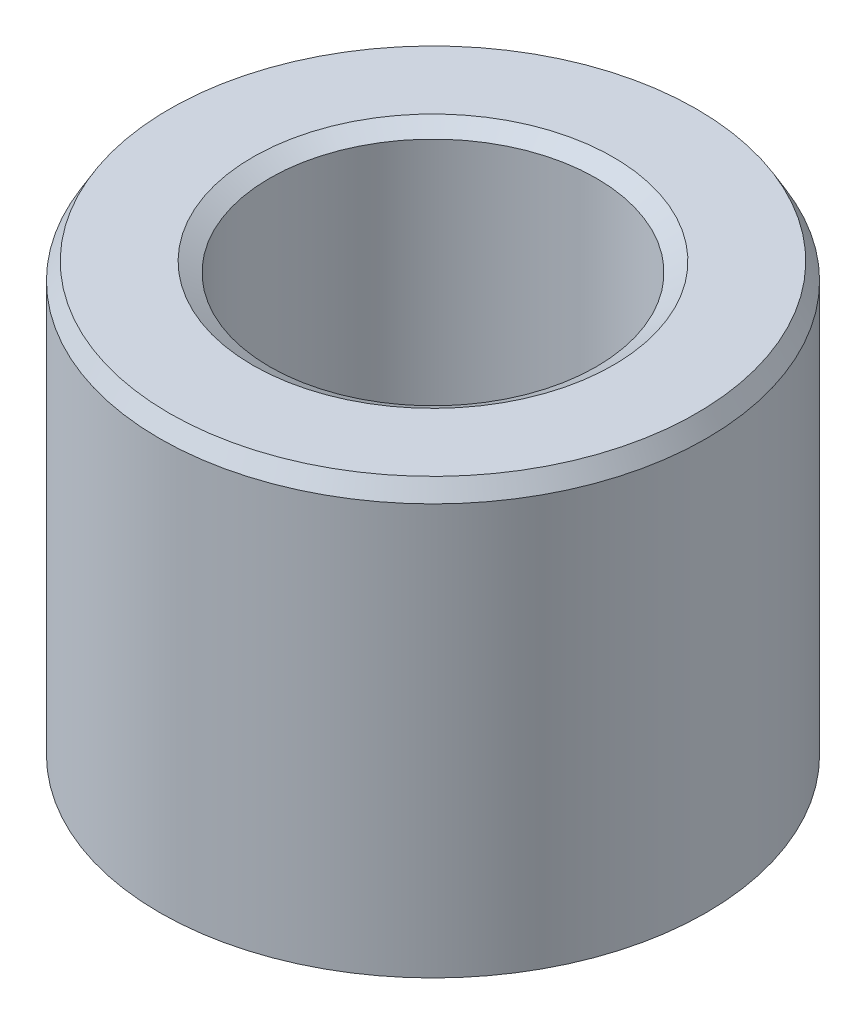
ISO-10303-21;
HEADER;
FILE_DESCRIPTION(('STEP AP214'),'2;1');
FILE_NAME('part.step','',(''),(''),'','','');
FILE_SCHEMA(('AUTOMOTIVE_DESIGN { 1 0 10303 214 1 1 1 1 }'));
ENDSEC;
DATA;
#1=APPLICATION_CONTEXT('core data for automotive mechanical design processes');
#2=APPLICATION_PROTOCOL_DEFINITION('international standard','automotive_design',2000,#1);
#3=PRODUCT_CONTEXT('',#1,'mechanical');
#4=PRODUCT('Part','Part','',(#3));
#5=PRODUCT_RELATED_PRODUCT_CATEGORY('part','',(#4));
#6=PRODUCT_DEFINITION_FORMATION('','',#4);
#7=PRODUCT_DEFINITION_CONTEXT('part definition',#1,'design');
#8=PRODUCT_DEFINITION('design','',#6,#7);
#9=PRODUCT_DEFINITION_SHAPE('','',#8);
#10=(LENGTH_UNIT() NAMED_UNIT(*) SI_UNIT(.MILLI.,.METRE.));
#11=(NAMED_UNIT(*) PLANE_ANGLE_UNIT() SI_UNIT($,.RADIAN.));
#12=(NAMED_UNIT(*) SI_UNIT($,.STERADIAN.) SOLID_ANGLE_UNIT());
#13=UNCERTAINTY_MEASURE_WITH_UNIT(LENGTH_MEASURE(1.E-05),#10,'distance_accuracy_value','');
#14=(GEOMETRIC_REPRESENTATION_CONTEXT(3) GLOBAL_UNCERTAINTY_ASSIGNED_CONTEXT((#13)) GLOBAL_UNIT_ASSIGNED_CONTEXT((#10,
#11,#12)) REPRESENTATION_CONTEXT('',''));
#15=CARTESIAN_POINT('',(0.,0.,0.));
#16=DIRECTION('',(0.,0.,1.));
#17=DIRECTION('',(1.,0.,0.));
#18=AXIS2_PLACEMENT_3D('',#15,#16,#17);
#19=CARTESIAN_POINT('',(0.,51.9870762394011,0.));
#20=DIRECTION('',(0.,-1.,0.));
#21=DIRECTION('',(0.,0.,-1.));
#22=AXIS2_PLACEMENT_3D('',#19,#20,#21);
#23=CYLINDRICAL_SURFACE('',#22,32.5);
#24=CARTESIAN_POINT('',(0.,1.16244475086012,0.));
#25=DIRECTION('',(0.,1.,0.));
#26=DIRECTION('',(0.,0.,1.));
#27=AXIS2_PLACEMENT_3D('',#24,#25,#26);
#28=CIRCLE('',#27,32.5);
#29=CARTESIAN_POINT('',(0.,1.16244475086012,-32.5));
#30=VERTEX_POINT('',#29);
#31=EDGE_CURVE('E10',#30,#30,#28,.T.);
#32=CARTESIAN_POINT('',(0.,49.9736628699198,0.));
#33=DIRECTION('',(0.,1.,0.));
#34=DIRECTION('',(0.,0.,1.));
#35=AXIS2_PLACEMENT_3D('',#32,#33,#34);
#36=CIRCLE('',#35,32.5);
#37=CARTESIAN_POINT('',(0.,49.9736628699198,-32.5));
#38=VERTEX_POINT('',#37);
#39=EDGE_CURVE('E50',#38,#38,#36,.F.);
#40=CARTESIAN_POINT('',(0.,1.16244475086012,-32.5));
#41=CARTESIAN_POINT('',(0.,1.67089493960032,-32.5));
#42=CARTESIAN_POINT('',(0.,2.17934512834052,-32.5));
#43=CARTESIAN_POINT('',(0.,3.19624550582093,-32.5));
#44=CARTESIAN_POINT('',(0.,3.70469569456114,-32.5));
#45=CARTESIAN_POINT('',(0.,4.72159607204155,-32.5));
#46=CARTESIAN_POINT('',(0.,5.23004626078176,-32.5));
#47=CARTESIAN_POINT('',(0.,6.24694663826217,-32.5));
#48=CARTESIAN_POINT('',(0.,6.75539682700237,-32.5));
#49=CARTESIAN_POINT('',(0.,7.77229720448278,-32.5));
#50=CARTESIAN_POINT('',(0.,8.28074739322299,-32.5));
#51=CARTESIAN_POINT('',(0.,9.2976477707034,-32.5));
#52=CARTESIAN_POINT('',(0.,9.8060979594436,-32.5));
#53=CARTESIAN_POINT('',(0.,10.822998336924,-32.5));
#54=CARTESIAN_POINT('',(0.,11.3314485256642,-32.5));
#55=CARTESIAN_POINT('',(0.,12.3483489031446,-32.5));
#56=CARTESIAN_POINT('',(0.,12.8567990918848,-32.5));
#57=CARTESIAN_POINT('',(0.,13.8736994693652,-32.5));
#58=CARTESIAN_POINT('',(0.,14.3821496581054,-32.5));
#59=CARTESIAN_POINT('',(0.,15.3990500355859,-32.5));
#60=CARTESIAN_POINT('',(0.,15.9075002243261,-32.5));
#61=CARTESIAN_POINT('',(0.,16.9244006018065,-32.5));
#62=CARTESIAN_POINT('',(0.,17.4328507905467,-32.5));
#63=CARTESIAN_POINT('',(0.,18.4497511680271,-32.5));
#64=CARTESIAN_POINT('',(0.,18.9582013567673,-32.5));
#65=CARTESIAN_POINT('',(0.,19.9751017342477,-32.5));
#66=CARTESIAN_POINT('',(0.,20.4835519229879,-32.5));
#67=CARTESIAN_POINT('',(0.,21.5004523004683,-32.5));
#68=CARTESIAN_POINT('',(0.,22.0089024892085,-32.5));
#69=CARTESIAN_POINT('',(0.,23.0258028666889,-32.5));
#70=CARTESIAN_POINT('',(0.,23.5342530554291,-32.5));
#71=CARTESIAN_POINT('',(0.,24.5511534329095,-32.5));
#72=CARTESIAN_POINT('',(0.,25.0596036216497,-32.5));
#73=CARTESIAN_POINT('',(0.,26.0765039991302,-32.5));
#74=CARTESIAN_POINT('',(0.,26.5849541878704,-32.5));
#75=CARTESIAN_POINT('',(0.,27.6018545653508,-32.5));
#76=CARTESIAN_POINT('',(0.,28.110304754091,-32.5));
#77=CARTESIAN_POINT('',(0.,29.1272051315714,-32.5));
#78=CARTESIAN_POINT('',(0.,29.6356553203116,-32.5));
#79=CARTESIAN_POINT('',(0.,30.652555697792,-32.5));
#80=CARTESIAN_POINT('',(0.,31.1610058865322,-32.5));
#81=CARTESIAN_POINT('',(0.,32.1779062640126,-32.5));
#82=CARTESIAN_POINT('',(0.,32.6863564527528,-32.5));
#83=CARTESIAN_POINT('',(0.,33.7032568302332,-32.5));
#84=CARTESIAN_POINT('',(0.,34.2117070189734,-32.5));
#85=CARTESIAN_POINT('',(0.,35.2286073964538,-32.5));
#86=CARTESIAN_POINT('',(0.,35.7370575851941,-32.5));
#87=CARTESIAN_POINT('',(0.,36.7539579626745,-32.5));
#88=CARTESIAN_POINT('',(0.,37.2624081514147,-32.5));
#89=CARTESIAN_POINT('',(0.,38.2793085288951,-32.5));
#90=CARTESIAN_POINT('',(0.,38.7877587176353,-32.5));
#91=CARTESIAN_POINT('',(0.,39.8046590951157,-32.5));
#92=CARTESIAN_POINT('',(0.,40.3131092838559,-32.5));
#93=CARTESIAN_POINT('',(0.,41.3300096613363,-32.5));
#94=CARTESIAN_POINT('',(0.,41.8384598500765,-32.5));
#95=CARTESIAN_POINT('',(0.,42.8553602275569,-32.5));
#96=CARTESIAN_POINT('',(0.,43.3638104162971,-32.5));
#97=CARTESIAN_POINT('',(0.,44.3807107937775,-32.5));
#98=CARTESIAN_POINT('',(0.,44.8891609825177,-32.5));
#99=CARTESIAN_POINT('',(0.,45.9060613599981,-32.5));
#100=CARTESIAN_POINT('',(0.,46.4145115487384,-32.5));
#101=CARTESIAN_POINT('',(0.,47.4314119262188,-32.5));
#102=CARTESIAN_POINT('',(0.,47.939862114959,-32.5));
#103=CARTESIAN_POINT('',(0.,48.9567624924394,-32.5));
#104=CARTESIAN_POINT('',(0.,49.4652126811796,-32.5));
#105=CARTESIAN_POINT('',(0.,49.9736628699198,-32.5));
#106=B_SPLINE_CURVE_WITH_KNOTS('',3,(#40,#41,#42,#43,#44,#45,#46,#47,#48,#49,#50,#51,#52,#53,
#54,#55,#56,#57,#58,#59,#60,#61,#62,#63,#64,#65,#66,#67,#68,#69,#70,#71,#72,#73,#74,#75,#76,#77,
#78,#79,#80,#81,#82,#83,#84,#85,#86,#87,#88,#89,#90,#91,#92,#93,#94,#95,#96,#97,#98,#99,#100,
#101,#102,#103,#104,#105),.UNSPECIFIED.,.F.,.F.,(4,2,2,2,2,2,2,2,2,2,2,2,2,2,2,2,2,2,2,2,2,2,2,
2,2,2,2,2,2,2,2,2,4),(0.,1.52535056622061,3.05070113244123,4.57605169866185,6.10140226488246,
7.62675283110308,9.15210339732369,10.6774539635443,12.2028045297649,13.7281550959855,
15.2535056622062,16.7788562284268,18.3042067946474,19.829557360868,21.3549079270886,
22.8802584933092,24.4056090595298,25.9309596257505,27.4563101919711,28.9816607581917,
30.5070113244123,32.0323618906329,33.5577124568535,35.0830630230741,36.6084135892947,
38.1337641555154,39.659114721736,41.1844652879566,42.7098158541772,44.2351664203978,
45.7605169866184,47.2858675528391,48.8112181190597),.UNSPECIFIED.);
#107=EDGE_CURVE('BSEAM39',#30,#38,#106,.T.);
#108=ORIENTED_EDGE('',*,*,#31,.T.);
#109=ORIENTED_EDGE('',*,*,#39,.T.);
#110=ORIENTED_EDGE('',*,*,#107,.T.);
#111=ORIENTED_EDGE('',*,*,#107,.F.);
#112=EDGE_LOOP('',(#108,#110,#109,#111));
#113=FACE_BOUND('',#112,.T.);
#114=ADVANCED_FACE('F39',(#113),#23,.T.);
#115=CARTESIAN_POINT('',(0.,51.9870762394011,0.));
#116=DIRECTION('',(0.,1.,0.));
#117=DIRECTION('',(0.,0.,1.));
#118=AXIS2_PLACEMENT_3D('',#115,#116,#117);
#119=PLANE('',#118);
#120=CARTESIAN_POINT('',(0.,51.9870762394011,0.));
#121=DIRECTION('',(0.,1.,0.));
#122=DIRECTION('',(0.,0.,1.));
#123=AXIS2_PLACEMENT_3D('',#120,#121,#122);
#124=CIRCLE('',#123,21.4318397049563);
#125=CARTESIAN_POINT('',(0.,51.9870762394011,21.4318397049563));
#126=VERTEX_POINT('',#125);
#127=EDGE_CURVE('E58',#126,#126,#124,.F.);
#128=ORIENTED_EDGE('',*,*,#127,.T.);
#129=EDGE_LOOP('',(#128));
#130=FACE_BOUND('',#129,.T.);
#131=CARTESIAN_POINT('',(0.,51.9870762394011,0.));
#132=DIRECTION('',(0.,1.,0.));
#133=DIRECTION('',(0.,0.,1.));
#134=AXIS2_PLACEMENT_3D('',#131,#132,#133);
#135=CIRCLE('',#134,31.33755524914);
#136=CARTESIAN_POINT('',(0.,51.9870762394011,31.33755524914));
#137=VERTEX_POINT('',#136);
#138=EDGE_CURVE('E61',#137,#137,#135,.T.);
#139=ORIENTED_EDGE('',*,*,#138,.T.);
#140=EDGE_LOOP('',(#139));
#141=FACE_BOUND('',#140,.T.);
#142=ADVANCED_FACE('F88',(#130,#141),#119,.T.);
#143=CARTESIAN_POINT('',(0.,0.,0.));
#144=DIRECTION('',(0.,1.,0.));
#145=DIRECTION('',(0.,0.,1.));
#146=AXIS2_PLACEMENT_3D('',#143,#144,#145);
#147=PLANE('',#146);
#148=CARTESIAN_POINT('',(0.,0.,0.));
#149=DIRECTION('',(0.,1.,0.));
#150=DIRECTION('',(0.,0.,1.));
#151=AXIS2_PLACEMENT_3D('',#148,#149,#150);
#152=CIRCLE('',#151,20.5808710863349);
#153=CARTESIAN_POINT('',(0.,0.,20.5808710863349));
#154=VERTEX_POINT('',#153);
#155=EDGE_CURVE('E51',#154,#154,#152,.T.);
#156=ORIENTED_EDGE('',*,*,#155,.T.);
#157=EDGE_LOOP('',(#156));
#158=FACE_BOUND('',#157,.T.);
#159=CARTESIAN_POINT('',(0.,0.,0.));
#160=DIRECTION('',(0.,1.,0.));
#161=DIRECTION('',(0.,0.,1.));
#162=AXIS2_PLACEMENT_3D('',#159,#160,#161);
#163=CIRCLE('',#162,30.4865866305185);
#164=CARTESIAN_POINT('',(0.,0.,30.4865866305185));
#165=VERTEX_POINT('',#164);
#166=EDGE_CURVE('E54',#165,#165,#163,.F.);
#167=ORIENTED_EDGE('',*,*,#166,.T.);
#168=EDGE_LOOP('',(#167));
#169=FACE_BOUND('',#168,.T.);
#170=ADVANCED_FACE('F83',(#158,#169),#147,.F.);
#171=CARTESIAN_POINT('',(0.,51.9870762394011,0.));
#172=DIRECTION('',(0.,-1.,0.));
#173=DIRECTION('',(0.,0.,-1.));
#174=AXIS2_PLACEMENT_3D('',#171,#172,#173);
#175=CYLINDRICAL_SURFACE('',#174,19.4184263354748);
#176=CARTESIAN_POINT('',(0.,50.824631488541,0.));
#177=DIRECTION('',(0.,1.,0.));
#178=DIRECTION('',(0.,0.,1.));
#179=AXIS2_PLACEMENT_3D('',#176,#177,#178);
#180=CIRCLE('',#179,19.4184263354748);
#181=CARTESIAN_POINT('',(0.,50.824631488541,-19.4184263354748));
#182=VERTEX_POINT('',#181);
#183=EDGE_CURVE('E67',#182,#182,#180,.T.);
#184=CARTESIAN_POINT('',(0.,2.01341336948142,0.));
#185=DIRECTION('',(0.,1.,0.));
#186=DIRECTION('',(0.,0.,1.));
#187=AXIS2_PLACEMENT_3D('',#184,#185,#186);
#188=CIRCLE('',#187,19.4184263354748);
#189=CARTESIAN_POINT('',(0.,2.01341336948142,-19.4184263354748));
#190=VERTEX_POINT('',#189);
#191=EDGE_CURVE('E69',#190,#190,#188,.F.);
#192=CARTESIAN_POINT('',(0.,50.824631488541,-19.4184263354748));
#193=CARTESIAN_POINT('',(0.,50.3161812998008,-19.4184263354748));
#194=CARTESIAN_POINT('',(0.,49.8077311110606,-19.4184263354748));
#195=CARTESIAN_POINT('',(0.,48.7908307335802,-19.4184263354748));
#196=CARTESIAN_POINT('',(0.,48.28238054484,-19.4184263354748));
#197=CARTESIAN_POINT('',(0.,47.2654801673596,-19.4184263354748));
#198=CARTESIAN_POINT('',(0.,46.7570299786194,-19.4184263354748));
#199=CARTESIAN_POINT('',(0.,45.740129601139,-19.4184263354748));
#200=CARTESIAN_POINT('',(0.,45.2316794123988,-19.4184263354748));
#201=CARTESIAN_POINT('',(0.,44.2147790349184,-19.4184263354748));
#202=CARTESIAN_POINT('',(0.,43.7063288461782,-19.4184263354748));
#203=CARTESIAN_POINT('',(0.,42.6894284686977,-19.4184263354748));
#204=CARTESIAN_POINT('',(0.,42.1809782799575,-19.4184263354748));
#205=CARTESIAN_POINT('',(0.,41.1640779024771,-19.4184263354748));
#206=CARTESIAN_POINT('',(0.,40.6556277137369,-19.4184263354748));
#207=CARTESIAN_POINT('',(0.,39.6387273362565,-19.4184263354748));
#208=CARTESIAN_POINT('',(0.,39.1302771475163,-19.4184263354748));
#209=CARTESIAN_POINT('',(0.,38.1133767700359,-19.4184263354748));
#210=CARTESIAN_POINT('',(0.,37.6049265812957,-19.4184263354748));
#211=CARTESIAN_POINT('',(0.,36.5880262038153,-19.4184263354748));
#212=CARTESIAN_POINT('',(0.,36.0795760150751,-19.4184263354748));
#213=CARTESIAN_POINT('',(0.,35.0626756375947,-19.4184263354748));
#214=CARTESIAN_POINT('',(0.,34.5542254488545,-19.4184263354748));
#215=CARTESIAN_POINT('',(0.,33.5373250713741,-19.4184263354748));
#216=CARTESIAN_POINT('',(0.,33.0288748826339,-19.4184263354748));
#217=CARTESIAN_POINT('',(0.,32.0119745051535,-19.4184263354748));
#218=CARTESIAN_POINT('',(0.,31.5035243164133,-19.4184263354748));
#219=CARTESIAN_POINT('',(0.,30.4866239389328,-19.4184263354748));
#220=CARTESIAN_POINT('',(0.,29.9781737501926,-19.4184263354748));
#221=CARTESIAN_POINT('',(0.,28.9612733727122,-19.4184263354748));
#222=CARTESIAN_POINT('',(0.,28.452823183972,-19.4184263354748));
#223=CARTESIAN_POINT('',(0.,27.4359228064916,-19.4184263354748));
#224=CARTESIAN_POINT('',(0.,26.9274726177514,-19.4184263354748));
#225=CARTESIAN_POINT('',(0.,25.910572240271,-19.4184263354748));
#226=CARTESIAN_POINT('',(0.,25.4021220515308,-19.4184263354748));
#227=CARTESIAN_POINT('',(0.,24.3852216740504,-19.4184263354748));
#228=CARTESIAN_POINT('',(0.,23.8767714853102,-19.4184263354748));
#229=CARTESIAN_POINT('',(0.,22.8598711078298,-19.4184263354748));
#230=CARTESIAN_POINT('',(0.,22.3514209190896,-19.4184263354748));
#231=CARTESIAN_POINT('',(0.,21.3345205416092,-19.4184263354748));
#232=CARTESIAN_POINT('',(0.,20.826070352869,-19.4184263354748));
#233=CARTESIAN_POINT('',(0.,19.8091699753886,-19.4184263354748));
#234=CARTESIAN_POINT('',(0.,19.3007197866484,-19.4184263354748));
#235=CARTESIAN_POINT('',(0.,18.283819409168,-19.4184263354748));
#236=CARTESIAN_POINT('',(0.,17.7753692204277,-19.4184263354748));
#237=CARTESIAN_POINT('',(0.,16.7584688429473,-19.4184263354748));
#238=CARTESIAN_POINT('',(0.,16.2500186542071,-19.4184263354748));
#239=CARTESIAN_POINT('',(0.,15.2331182767267,-19.4184263354748));
#240=CARTESIAN_POINT('',(0.,14.7246680879865,-19.4184263354748));
#241=CARTESIAN_POINT('',(0.,13.7077677105061,-19.4184263354748));
#242=CARTESIAN_POINT('',(0.,13.1993175217659,-19.4184263354748));
#243=CARTESIAN_POINT('',(0.,12.1824171442855,-19.4184263354748));
#244=CARTESIAN_POINT('',(0.,11.6739669555453,-19.4184263354748));
#245=CARTESIAN_POINT('',(0.,10.6570665780649,-19.4184263354748));
#246=CARTESIAN_POINT('',(0.,10.1486163893247,-19.4184263354748));
#247=CARTESIAN_POINT('',(0.,9.13171601184428,-19.4184263354748));
#248=CARTESIAN_POINT('',(0.,8.62326582310407,-19.4184263354748));
#249=CARTESIAN_POINT('',(0.,7.60636544562366,-19.4184263354748));
#250=CARTESIAN_POINT('',(0.,7.09791525688346,-19.4184263354748));
#251=CARTESIAN_POINT('',(0.,6.08101487940305,-19.4184263354748));
#252=CARTESIAN_POINT('',(0.,5.57256469066285,-19.4184263354748));
#253=CARTESIAN_POINT('',(0.,4.55566431318244,-19.4184263354748));
#254=CARTESIAN_POINT('',(0.,4.04721412444224,-19.4184263354748));
#255=CARTESIAN_POINT('',(0.,3.03031374696183,-19.4184263354748));
#256=CARTESIAN_POINT('',(0.,2.52186355822162,-19.4184263354748));
#257=CARTESIAN_POINT('',(0.,2.01341336948142,-19.4184263354748));
#258=B_SPLINE_CURVE_WITH_KNOTS('',3,(#192,#193,#194,#195,#196,#197,#198,#199,#200,#201,#202,
#203,#204,#205,#206,#207,#208,#209,#210,#211,#212,#213,#214,#215,#216,#217,#218,#219,#220,#221,
#222,#223,#224,#225,#226,#227,#228,#229,#230,#231,#232,#233,#234,#235,#236,#237,#238,#239,#240,
#241,#242,#243,#244,#245,#246,#247,#248,#249,#250,#251,#252,#253,#254,#255,#256,#257),
.UNSPECIFIED.,.F.,.F.,(4,2,2,2,2,2,2,2,2,2,2,2,2,2,2,2,2,2,2,2,2,2,2,2,2,2,2,2,2,2,2,2,4),(0.,
1.52535056622061,3.05070113244123,4.57605169866184,6.10140226488245,7.62675283110306,
9.15210339732368,10.6774539635443,12.2028045297649,13.7281550959855,15.2535056622061,
16.7788562284267,18.3042067946474,19.829557360868,21.3549079270886,22.8802584933092,
24.4056090595298,25.9309596257504,27.456310191971,28.9816607581916,30.5070113244122,
32.0323618906329,33.5577124568535,35.0830630230741,36.6084135892947,38.1337641555153,
39.6591147217359,41.1844652879565,42.7098158541771,44.2351664203978,45.7605169866184,
47.285867552839,48.8112181190596),.UNSPECIFIED.);
#259=EDGE_CURVE('BSEAM71',#182,#190,#258,.T.);
#260=ORIENTED_EDGE('',*,*,#183,.T.);
#261=ORIENTED_EDGE('',*,*,#191,.T.);
#262=ORIENTED_EDGE('',*,*,#259,.T.);
#263=ORIENTED_EDGE('',*,*,#259,.F.);
#264=EDGE_LOOP('',(#260,#262,#261,#263));
#265=FACE_BOUND('',#264,.T.);
#266=ADVANCED_FACE('F71',(#265),#175,.F.);
#267=CARTESIAN_POINT('',(0.,50.824631488541,0.));
#268=DIRECTION('',(0.,1.,0.));
#269=DIRECTION('',(0.,0.,1.));
#270=AXIS2_PLACEMENT_3D('',#267,#268,#269);
#271=CONICAL_SURFACE('',#270,19.4184263354748,1.0471975511966);
#272=ORIENTED_EDGE('',*,*,#127,.F.);
#273=EDGE_LOOP('',(#272));
#274=FACE_BOUND('',#273,.T.);
#275=ORIENTED_EDGE('',*,*,#183,.F.);
#276=EDGE_LOOP('',(#275));
#277=FACE_BOUND('',#276,.T.);
#278=ADVANCED_FACE('F77',(#274,#277),#271,.F.);
#279=CARTESIAN_POINT('',(0.,0.,0.));
#280=DIRECTION('',(0.,-1.,0.));
#281=DIRECTION('',(0.,0.,-1.));
#282=AXIS2_PLACEMENT_3D('',#279,#280,#281);
#283=CONICAL_SURFACE('',#282,20.5808710863349,0.523598775598295);
#284=ORIENTED_EDGE('',*,*,#191,.F.);
#285=EDGE_LOOP('',(#284));
#286=FACE_BOUND('',#285,.T.);
#287=ORIENTED_EDGE('',*,*,#155,.F.);
#288=EDGE_LOOP('',(#287));
#289=FACE_BOUND('',#288,.T.);
#290=ADVANCED_FACE('F73',(#286,#289),#283,.F.);
#291=CARTESIAN_POINT('',(0.,1.16244475086012,0.));
#292=DIRECTION('',(0.,1.,0.));
#293=DIRECTION('',(0.,0.,1.));
#294=AXIS2_PLACEMENT_3D('',#291,#292,#293);
#295=CONICAL_SURFACE('',#294,32.5,1.0471975511966);
#296=ORIENTED_EDGE('',*,*,#166,.F.);
#297=EDGE_LOOP('',(#296));
#298=FACE_BOUND('',#297,.T.);
#299=ORIENTED_EDGE('',*,*,#31,.F.);
#300=EDGE_LOOP('',(#299));
#301=FACE_BOUND('',#300,.T.);
#302=ADVANCED_FACE('F76',(#298,#301),#295,.T.);
#303=CARTESIAN_POINT('',(0.,51.9870762394011,0.));
#304=DIRECTION('',(0.,-1.,0.));
#305=DIRECTION('',(0.,0.,-1.));
#306=AXIS2_PLACEMENT_3D('',#303,#304,#305);
#307=CONICAL_SURFACE('',#306,31.33755524914,0.523598775598299);
#308=ORIENTED_EDGE('',*,*,#39,.F.);
#309=EDGE_LOOP('',(#308));
#310=FACE_BOUND('',#309,.T.);
#311=ORIENTED_EDGE('',*,*,#138,.F.);
#312=EDGE_LOOP('',(#311));
#313=FACE_BOUND('',#312,.T.);
#314=ADVANCED_FACE('F45',(#310,#313),#307,.T.);
#315=CLOSED_SHELL('',(#114,#142,#170,#266,#278,#290,#302,#314));
#316=MANIFOLD_SOLID_BREP('B2',#315);
#317=ADVANCED_BREP_SHAPE_REPRESENTATION('',(#18,#316),#14);
#318=SHAPE_DEFINITION_REPRESENTATION(#9,#317);
ENDSEC;
END-ISO-10303-21;
